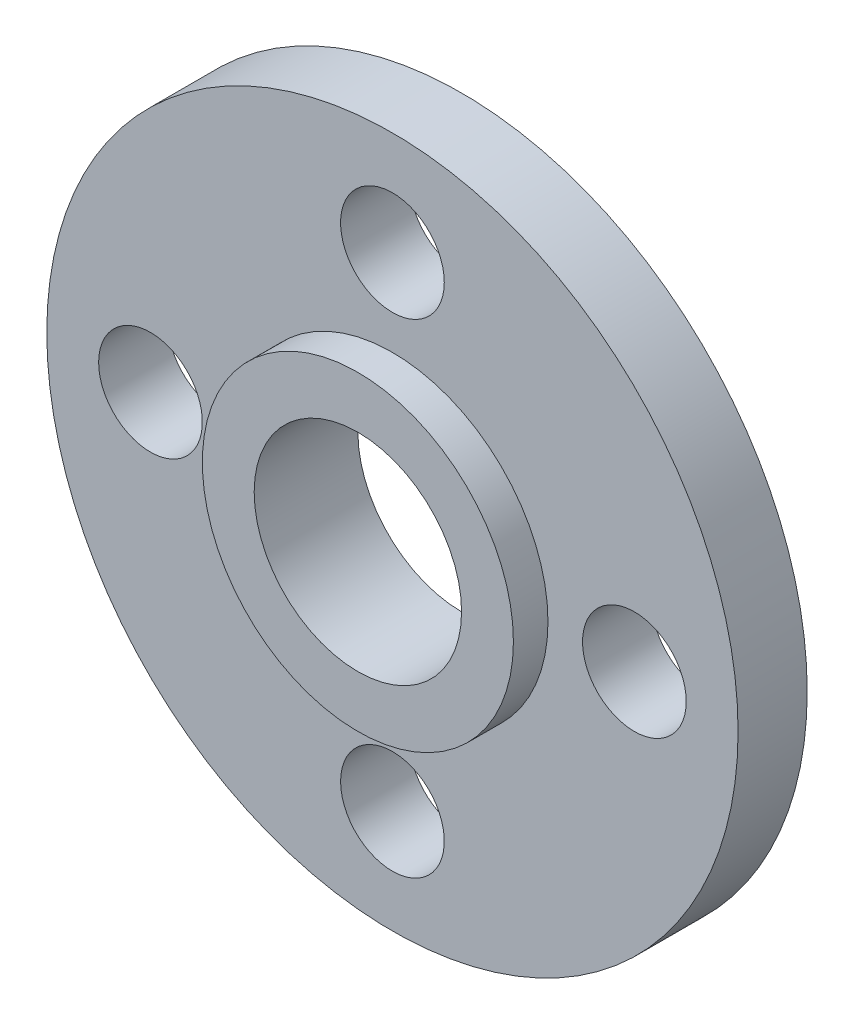
ISO-10303-21;
HEADER;
FILE_DESCRIPTION(('STEP AP214'),'2;1');
FILE_NAME('part.step','',(''),(''),'','','');
FILE_SCHEMA(('AUTOMOTIVE_DESIGN { 1 0 10303 214 1 1 1 1 }'));
ENDSEC;
DATA;
#1=APPLICATION_CONTEXT('core data for automotive mechanical design processes');
#2=APPLICATION_PROTOCOL_DEFINITION('international standard','automotive_design',2000,#1);
#3=PRODUCT_CONTEXT('',#1,'mechanical');
#4=PRODUCT('Part','Part','',(#3));
#5=PRODUCT_RELATED_PRODUCT_CATEGORY('part','',(#4));
#6=PRODUCT_DEFINITION_FORMATION('','',#4);
#7=PRODUCT_DEFINITION_CONTEXT('part definition',#1,'design');
#8=PRODUCT_DEFINITION('design','',#6,#7);
#9=PRODUCT_DEFINITION_SHAPE('','',#8);
#10=(LENGTH_UNIT() NAMED_UNIT(*) SI_UNIT(.MILLI.,.METRE.));
#11=(NAMED_UNIT(*) PLANE_ANGLE_UNIT() SI_UNIT($,.RADIAN.));
#12=(NAMED_UNIT(*) SI_UNIT($,.STERADIAN.) SOLID_ANGLE_UNIT());
#13=UNCERTAINTY_MEASURE_WITH_UNIT(LENGTH_MEASURE(1.E-05),#10,'distance_accuracy_value','');
#14=(GEOMETRIC_REPRESENTATION_CONTEXT(3) GLOBAL_UNCERTAINTY_ASSIGNED_CONTEXT((#13)) GLOBAL_UNIT_ASSIGNED_CONTEXT((#10,
#11,#12)) REPRESENTATION_CONTEXT('',''));
#15=CARTESIAN_POINT('',(0.,0.,0.));
#16=DIRECTION('',(0.,0.,1.));
#17=DIRECTION('',(1.,0.,0.));
#18=AXIS2_PLACEMENT_3D('',#15,#16,#17);
#19=CARTESIAN_POINT('',(0.,0.,2.));
#20=DIRECTION('',(0.,0.,1.));
#21=DIRECTION('',(1.,0.,0.));
#22=AXIS2_PLACEMENT_3D('',#19,#20,#21);
#23=PLANE('',#22);
#24=CARTESIAN_POINT('',(0.,0.,2.));
#25=DIRECTION('',(0.,0.,1.));
#26=DIRECTION('',(1.,0.,0.));
#27=AXIS2_PLACEMENT_3D('',#24,#25,#26);
#28=CIRCLE('',#27,10.);
#29=CARTESIAN_POINT('',(10.,0.,2.));
#30=VERTEX_POINT('',#29);
#31=EDGE_CURVE('E10',#30,#30,#28,.T.);
#32=ORIENTED_EDGE('',*,*,#31,.T.);
#33=EDGE_LOOP('',(#32));
#34=FACE_BOUND('',#33,.T.);
#35=CARTESIAN_POINT('',(-7.,0.,2.));
#36=DIRECTION('',(0.,0.,1.));
#37=DIRECTION('',(-1.,0.,0.));
#38=AXIS2_PLACEMENT_3D('',#35,#36,#37);
#39=CIRCLE('',#38,1.5);
#40=CARTESIAN_POINT('',(-8.5,0.,2.));
#41=VERTEX_POINT('',#40);
#42=EDGE_CURVE('E46',#41,#41,#39,.T.);
#43=ORIENTED_EDGE('',*,*,#42,.F.);
#44=EDGE_LOOP('',(#43));
#45=FACE_BOUND('',#44,.T.);
#46=CARTESIAN_POINT('',(0.,-7.,2.));
#47=DIRECTION('',(0.,0.,1.));
#48=DIRECTION('',(-1.,0.,0.));
#49=AXIS2_PLACEMENT_3D('',#46,#47,#48);
#50=CIRCLE('',#49,1.5);
#51=CARTESIAN_POINT('',(-1.5,-7.,2.));
#52=VERTEX_POINT('',#51);
#53=EDGE_CURVE('E53',#52,#52,#50,.T.);
#54=ORIENTED_EDGE('',*,*,#53,.F.);
#55=EDGE_LOOP('',(#54));
#56=FACE_BOUND('',#55,.T.);
#57=CARTESIAN_POINT('',(7.,0.,2.));
#58=DIRECTION('',(0.,0.,1.));
#59=DIRECTION('',(1.,0.,0.));
#60=AXIS2_PLACEMENT_3D('',#57,#58,#59);
#61=CIRCLE('',#60,1.5);
#62=CARTESIAN_POINT('',(8.5,0.,2.));
#63=VERTEX_POINT('',#62);
#64=EDGE_CURVE('E59',#63,#63,#61,.T.);
#65=ORIENTED_EDGE('',*,*,#64,.F.);
#66=EDGE_LOOP('',(#65));
#67=FACE_BOUND('',#66,.T.);
#68=CARTESIAN_POINT('',(0.,7.,2.));
#69=DIRECTION('',(0.,0.,1.));
#70=DIRECTION('',(1.,0.,0.));
#71=AXIS2_PLACEMENT_3D('',#68,#69,#70);
#72=CIRCLE('',#71,1.5);
#73=CARTESIAN_POINT('',(1.5,7.,2.));
#74=VERTEX_POINT('',#73);
#75=EDGE_CURVE('E65',#74,#74,#72,.T.);
#76=ORIENTED_EDGE('',*,*,#75,.F.);
#77=EDGE_LOOP('',(#76));
#78=FACE_BOUND('',#77,.T.);
#79=CARTESIAN_POINT('',(0.,0.,2.));
#80=DIRECTION('',(0.,0.,1.));
#81=DIRECTION('',(1.,0.,0.));
#82=AXIS2_PLACEMENT_3D('',#79,#80,#81);
#83=CIRCLE('',#82,4.5);
#84=CARTESIAN_POINT('',(4.5,0.,2.));
#85=VERTEX_POINT('',#84);
#86=EDGE_CURVE('E73',#85,#85,#83,.T.);
#87=ORIENTED_EDGE('',*,*,#86,.F.);
#88=EDGE_LOOP('',(#87));
#89=FACE_BOUND('',#88,.T.);
#90=ADVANCED_FACE('F33',(#34,#45,#56,#67,#78,#89),#23,.T.);
#91=CARTESIAN_POINT('',(0.,0.,2.));
#92=DIRECTION('',(0.,0.,-1.));
#93=DIRECTION('',(-1.,0.,0.));
#94=AXIS2_PLACEMENT_3D('',#91,#92,#93);
#95=CYLINDRICAL_SURFACE('',#94,10.);
#96=ORIENTED_EDGE('',*,*,#31,.F.);
#97=EDGE_LOOP('',(#96));
#98=FACE_BOUND('',#97,.T.);
#99=CARTESIAN_POINT('',(0.,0.,0.));
#100=DIRECTION('',(0.,0.,1.));
#101=DIRECTION('',(1.,0.,0.));
#102=AXIS2_PLACEMENT_3D('',#99,#100,#101);
#103=CIRCLE('',#102,10.);
#104=CARTESIAN_POINT('',(10.,0.,0.));
#105=VERTEX_POINT('',#104);
#106=EDGE_CURVE('E37',#105,#105,#103,.T.);
#107=ORIENTED_EDGE('',*,*,#106,.T.);
#108=EDGE_LOOP('',(#107));
#109=FACE_BOUND('',#108,.T.);
#110=ADVANCED_FACE('F35',(#98,#109),#95,.T.);
#111=CARTESIAN_POINT('',(0.,0.,0.));
#112=DIRECTION('',(0.,0.,1.));
#113=DIRECTION('',(1.,0.,0.));
#114=AXIS2_PLACEMENT_3D('',#111,#112,#113);
#115=PLANE('',#114);
#116=CARTESIAN_POINT('',(0.,0.,0.));
#117=DIRECTION('',(0.,0.,1.));
#118=DIRECTION('',(1.,0.,0.));
#119=AXIS2_PLACEMENT_3D('',#116,#117,#118);
#120=CIRCLE('',#119,3.);
#121=CARTESIAN_POINT('',(3.,0.,0.));
#122=VERTEX_POINT('',#121);
#123=EDGE_CURVE('E50',#122,#122,#120,.T.);
#124=ORIENTED_EDGE('',*,*,#123,.T.);
#125=EDGE_LOOP('',(#124));
#126=FACE_BOUND('',#125,.T.);
#127=CARTESIAN_POINT('',(0.,7.,0.));
#128=DIRECTION('',(0.,0.,1.));
#129=DIRECTION('',(1.,0.,0.));
#130=AXIS2_PLACEMENT_3D('',#127,#128,#129);
#131=CIRCLE('',#130,1.5);
#132=CARTESIAN_POINT('',(1.5,7.,0.));
#133=VERTEX_POINT('',#132);
#134=EDGE_CURVE('E44',#133,#133,#131,.T.);
#135=ORIENTED_EDGE('',*,*,#134,.T.);
#136=EDGE_LOOP('',(#135));
#137=FACE_BOUND('',#136,.T.);
#138=CARTESIAN_POINT('',(7.,0.,0.));
#139=DIRECTION('',(0.,0.,1.));
#140=DIRECTION('',(1.,0.,0.));
#141=AXIS2_PLACEMENT_3D('',#138,#139,#140);
#142=CIRCLE('',#141,1.5);
#143=CARTESIAN_POINT('',(8.5,0.,0.));
#144=VERTEX_POINT('',#143);
#145=EDGE_CURVE('E62',#144,#144,#142,.T.);
#146=ORIENTED_EDGE('',*,*,#145,.T.);
#147=EDGE_LOOP('',(#146));
#148=FACE_BOUND('',#147,.T.);
#149=CARTESIAN_POINT('',(0.,-7.,0.));
#150=DIRECTION('',(0.,0.,1.));
#151=DIRECTION('',(-1.,0.,0.));
#152=AXIS2_PLACEMENT_3D('',#149,#150,#151);
#153=CIRCLE('',#152,1.5);
#154=CARTESIAN_POINT('',(-1.5,-7.,0.));
#155=VERTEX_POINT('',#154);
#156=EDGE_CURVE('E56',#155,#155,#153,.T.);
#157=ORIENTED_EDGE('',*,*,#156,.T.);
#158=EDGE_LOOP('',(#157));
#159=FACE_BOUND('',#158,.T.);
#160=CARTESIAN_POINT('',(-7.,0.,0.));
#161=DIRECTION('',(0.,0.,1.));
#162=DIRECTION('',(-1.,0.,0.));
#163=AXIS2_PLACEMENT_3D('',#160,#161,#162);
#164=CIRCLE('',#163,1.5);
#165=CARTESIAN_POINT('',(-8.5,0.,0.));
#166=VERTEX_POINT('',#165);
#167=EDGE_CURVE('E49',#166,#166,#164,.T.);
#168=ORIENTED_EDGE('',*,*,#167,.T.);
#169=EDGE_LOOP('',(#168));
#170=FACE_BOUND('',#169,.T.);
#171=ORIENTED_EDGE('',*,*,#106,.F.);
#172=EDGE_LOOP('',(#171));
#173=FACE_BOUND('',#172,.T.);
#174=ADVANCED_FACE('F103',(#126,#137,#148,#159,#170,#173),#115,.F.);
#175=CARTESIAN_POINT('',(-7.,0.,0.));
#176=DIRECTION('',(0.,0.,1.));
#177=DIRECTION('',(1.,0.,0.));
#178=AXIS2_PLACEMENT_3D('',#175,#176,#177);
#179=CYLINDRICAL_SURFACE('',#178,1.5);
#180=ORIENTED_EDGE('',*,*,#167,.F.);
#181=EDGE_LOOP('',(#180));
#182=FACE_BOUND('',#181,.T.);
#183=ORIENTED_EDGE('',*,*,#42,.T.);
#184=EDGE_LOOP('',(#183));
#185=FACE_BOUND('',#184,.T.);
#186=ADVANCED_FACE('F107',(#182,#185),#179,.F.);
#187=CARTESIAN_POINT('',(0.,-7.,0.));
#188=DIRECTION('',(0.,0.,1.));
#189=DIRECTION('',(1.,0.,0.));
#190=AXIS2_PLACEMENT_3D('',#187,#188,#189);
#191=CYLINDRICAL_SURFACE('',#190,1.5);
#192=ORIENTED_EDGE('',*,*,#156,.F.);
#193=EDGE_LOOP('',(#192));
#194=FACE_BOUND('',#193,.T.);
#195=ORIENTED_EDGE('',*,*,#53,.T.);
#196=EDGE_LOOP('',(#195));
#197=FACE_BOUND('',#196,.T.);
#198=ADVANCED_FACE('F114',(#194,#197),#191,.F.);
#199=CARTESIAN_POINT('',(7.,0.,0.));
#200=DIRECTION('',(0.,0.,1.));
#201=DIRECTION('',(1.,0.,0.));
#202=AXIS2_PLACEMENT_3D('',#199,#200,#201);
#203=CYLINDRICAL_SURFACE('',#202,1.5);
#204=ORIENTED_EDGE('',*,*,#145,.F.);
#205=EDGE_LOOP('',(#204));
#206=FACE_BOUND('',#205,.T.);
#207=ORIENTED_EDGE('',*,*,#64,.T.);
#208=EDGE_LOOP('',(#207));
#209=FACE_BOUND('',#208,.T.);
#210=ADVANCED_FACE('F141',(#206,#209),#203,.F.);
#211=CARTESIAN_POINT('',(0.,7.,0.));
#212=DIRECTION('',(0.,0.,1.));
#213=DIRECTION('',(1.,0.,0.));
#214=AXIS2_PLACEMENT_3D('',#211,#212,#213);
#215=CYLINDRICAL_SURFACE('',#214,1.5);
#216=ORIENTED_EDGE('',*,*,#134,.F.);
#217=EDGE_LOOP('',(#216));
#218=FACE_BOUND('',#217,.T.);
#219=ORIENTED_EDGE('',*,*,#75,.T.);
#220=EDGE_LOOP('',(#219));
#221=FACE_BOUND('',#220,.T.);
#222=ADVANCED_FACE('F95',(#218,#221),#215,.F.);
#223=CARTESIAN_POINT('',(0.,0.,0.));
#224=DIRECTION('',(0.,0.,1.));
#225=DIRECTION('',(1.,0.,0.));
#226=AXIS2_PLACEMENT_3D('',#223,#224,#225);
#227=CYLINDRICAL_SURFACE('',#226,3.);
#228=ORIENTED_EDGE('',*,*,#123,.F.);
#229=EDGE_LOOP('',(#228));
#230=FACE_BOUND('',#229,.T.);
#231=CARTESIAN_POINT('',(0.,0.,3.));
#232=DIRECTION('',(0.,0.,1.));
#233=DIRECTION('',(1.,0.,0.));
#234=AXIS2_PLACEMENT_3D('',#231,#232,#233);
#235=CIRCLE('',#234,3.);
#236=CARTESIAN_POINT('',(3.,0.,3.));
#237=VERTEX_POINT('',#236);
#238=EDGE_CURVE('E76',#237,#237,#235,.T.);
#239=ORIENTED_EDGE('',*,*,#238,.T.);
#240=EDGE_LOOP('',(#239));
#241=FACE_BOUND('',#240,.T.);
#242=ADVANCED_FACE('F82',(#230,#241),#227,.F.);
#243=CARTESIAN_POINT('',(0.,0.,3.));
#244=DIRECTION('',(0.,0.,1.));
#245=DIRECTION('',(1.,0.,0.));
#246=AXIS2_PLACEMENT_3D('',#243,#244,#245);
#247=PLANE('',#246);
#248=CARTESIAN_POINT('',(0.,0.,3.));
#249=DIRECTION('',(0.,0.,1.));
#250=DIRECTION('',(1.,0.,0.));
#251=AXIS2_PLACEMENT_3D('',#248,#249,#250);
#252=CIRCLE('',#251,4.5);
#253=CARTESIAN_POINT('',(4.5,0.,3.));
#254=VERTEX_POINT('',#253);
#255=EDGE_CURVE('E72',#254,#254,#252,.T.);
#256=ORIENTED_EDGE('',*,*,#255,.T.);
#257=EDGE_LOOP('',(#256));
#258=FACE_BOUND('',#257,.T.);
#259=ORIENTED_EDGE('',*,*,#238,.F.);
#260=EDGE_LOOP('',(#259));
#261=FACE_BOUND('',#260,.T.);
#262=ADVANCED_FACE('F84',(#258,#261),#247,.T.);
#263=CARTESIAN_POINT('',(0.,0.,3.));
#264=DIRECTION('',(0.,0.,-1.));
#265=DIRECTION('',(-1.,0.,0.));
#266=AXIS2_PLACEMENT_3D('',#263,#264,#265);
#267=CYLINDRICAL_SURFACE('',#266,4.5);
#268=ORIENTED_EDGE('',*,*,#255,.F.);
#269=EDGE_LOOP('',(#268));
#270=FACE_BOUND('',#269,.T.);
#271=ORIENTED_EDGE('',*,*,#86,.T.);
#272=EDGE_LOOP('',(#271));
#273=FACE_BOUND('',#272,.T.);
#274=ADVANCED_FACE('F86',(#270,#273),#267,.T.);
#275=CLOSED_SHELL('',(#90,#110,#174,#186,#198,#210,#222,#242,#262,#274));
#276=MANIFOLD_SOLID_BREP('B2',#275);
#277=ADVANCED_BREP_SHAPE_REPRESENTATION('',(#18,#276),#14);
#278=SHAPE_DEFINITION_REPRESENTATION(#9,#277);
ENDSEC;
END-ISO-10303-21;
